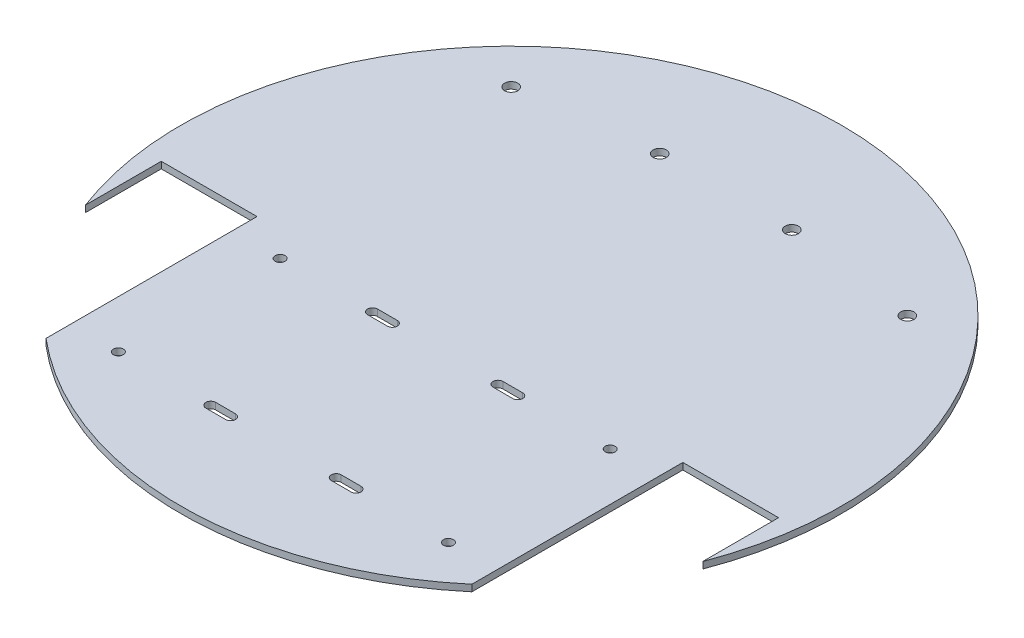
ISO-10303-21;
HEADER;
FILE_DESCRIPTION(('STEP AP214'),'2;1');
FILE_NAME('part.step','',(''),(''),'','','');
FILE_SCHEMA(('AUTOMOTIVE_DESIGN { 1 0 10303 214 1 1 1 1 }'));
ENDSEC;
DATA;
#1=APPLICATION_CONTEXT('core data for automotive mechanical design processes');
#2=APPLICATION_PROTOCOL_DEFINITION('international standard','automotive_design',2000,#1);
#3=PRODUCT_CONTEXT('',#1,'mechanical');
#4=PRODUCT('Part','Part','',(#3));
#5=PRODUCT_RELATED_PRODUCT_CATEGORY('part','',(#4));
#6=PRODUCT_DEFINITION_FORMATION('','',#4);
#7=PRODUCT_DEFINITION_CONTEXT('part definition',#1,'design');
#8=PRODUCT_DEFINITION('design','',#6,#7);
#9=PRODUCT_DEFINITION_SHAPE('','',#8);
#10=(LENGTH_UNIT() NAMED_UNIT(*) SI_UNIT(.MILLI.,.METRE.));
#11=(NAMED_UNIT(*) PLANE_ANGLE_UNIT() SI_UNIT($,.RADIAN.));
#12=(NAMED_UNIT(*) SI_UNIT($,.STERADIAN.) SOLID_ANGLE_UNIT());
#13=UNCERTAINTY_MEASURE_WITH_UNIT(LENGTH_MEASURE(1.E-05),#10,'distance_accuracy_value','');
#14=(GEOMETRIC_REPRESENTATION_CONTEXT(3) GLOBAL_UNCERTAINTY_ASSIGNED_CONTEXT((#13)) GLOBAL_UNIT_ASSIGNED_CONTEXT((#10,
#11,#12)) REPRESENTATION_CONTEXT('',''));
#15=CARTESIAN_POINT('',(0.,0.,0.));
#16=DIRECTION('',(0.,0.,1.));
#17=DIRECTION('',(1.,0.,0.));
#18=AXIS2_PLACEMENT_3D('',#15,#16,#17);
#19=CARTESIAN_POINT('',(93.5,2.,-1.13005537547703E-13));
#20=DIRECTION('',(1.,0.,0.));
#21=DIRECTION('',(0.,0.,-1.));
#22=AXIS2_PLACEMENT_3D('',#19,#20,#21);
#23=PLANE('',#22);
#24=DIRECTION('',(0.,0.,1.));
#25=VECTOR('',#24,1.);
#26=CARTESIAN_POINT('',(93.5,0.,-1.13005537547703E-13));
#27=LINE('',#26,#25);
#28=CARTESIAN_POINT('',(93.5,0.,12.5));
#29=VERTEX_POINT('',#28);
#30=CARTESIAN_POINT('',(93.5,0.,35.4647712526107));
#31=VERTEX_POINT('',#30);
#32=EDGE_CURVE('E304',#29,#31,#27,.T.);
#33=ORIENTED_EDGE('',*,*,#32,.T.);
#34=DIRECTION('',(0.,-1.,0.));
#35=VECTOR('',#34,1.);
#36=CARTESIAN_POINT('',(93.5,2.,35.4647712526107));
#37=LINE('',#36,#35);
#38=CARTESIAN_POINT('',(93.5,2.,35.4647712526107));
#39=VERTEX_POINT('',#38);
#40=EDGE_CURVE('E11',#39,#31,#37,.T.);
#41=ORIENTED_EDGE('',*,*,#40,.F.);
#42=DIRECTION('',(0.,0.,1.));
#43=VECTOR('',#42,1.);
#44=CARTESIAN_POINT('',(93.5,2.,-1.13005537547703E-13));
#45=LINE('',#44,#43);
#46=CARTESIAN_POINT('',(93.5,2.,12.5));
#47=VERTEX_POINT('',#46);
#48=EDGE_CURVE('E436',#47,#39,#45,.T.);
#49=ORIENTED_EDGE('',*,*,#48,.F.);
#50=DIRECTION('',(0.,-1.,0.));
#51=VECTOR('',#50,1.);
#52=CARTESIAN_POINT('',(93.5,2.,12.5));
#53=LINE('',#52,#51);
#54=EDGE_CURVE('E54',#47,#29,#53,.T.);
#55=ORIENTED_EDGE('',*,*,#54,.T.);
#56=EDGE_LOOP('',(#33,#41,#49,#55));
#57=FACE_BOUND('',#56,.T.);
#58=ADVANCED_FACE('F35',(#57),#23,.F.);
#59=CARTESIAN_POINT('',(0.,2.,0.));
#60=DIRECTION('',(0.,-1.,0.));
#61=DIRECTION('',(0.,0.,-1.));
#62=AXIS2_PLACEMENT_3D('',#59,#60,#61);
#63=CYLINDRICAL_SURFACE('',#62,100.);
#64=CARTESIAN_POINT('',(0.,0.,0.));
#65=DIRECTION('',(0.,1.,0.));
#66=DIRECTION('',(0.,0.,1.));
#67=AXIS2_PLACEMENT_3D('',#64,#65,#66);
#68=CIRCLE('',#67,100.);
#69=CARTESIAN_POINT('',(-93.5,0.,35.4647712526107));
#70=VERTEX_POINT('',#69);
#71=EDGE_CURVE('E306',#31,#70,#68,.T.);
#72=ORIENTED_EDGE('',*,*,#71,.T.);
#73=DIRECTION('',(0.,-1.,0.));
#74=VECTOR('',#73,1.);
#75=CARTESIAN_POINT('',(-93.5,2.,35.4647712526107));
#76=LINE('',#75,#74);
#77=CARTESIAN_POINT('',(-93.5,2.,35.4647712526107));
#78=VERTEX_POINT('',#77);
#79=EDGE_CURVE('E45',#78,#70,#76,.T.);
#80=ORIENTED_EDGE('',*,*,#79,.F.);
#81=CARTESIAN_POINT('',(0.,2.,0.));
#82=DIRECTION('',(0.,1.,0.));
#83=DIRECTION('',(0.,0.,1.));
#84=AXIS2_PLACEMENT_3D('',#81,#82,#83);
#85=CIRCLE('',#84,100.);
#86=EDGE_CURVE('E438',#39,#78,#85,.T.);
#87=ORIENTED_EDGE('',*,*,#86,.F.);
#88=ORIENTED_EDGE('',*,*,#40,.T.);
#89=EDGE_LOOP('',(#72,#80,#87,#88));
#90=FACE_BOUND('',#89,.T.);
#91=ADVANCED_FACE('F471',(#90),#63,.T.);
#92=CARTESIAN_POINT('',(-93.5,2.,-1.13005537547703E-13));
#93=DIRECTION('',(1.,0.,0.));
#94=DIRECTION('',(0.,0.,-1.));
#95=AXIS2_PLACEMENT_3D('',#92,#93,#94);
#96=PLANE('',#95);
#97=DIRECTION('',(0.,0.,1.));
#98=VECTOR('',#97,1.);
#99=CARTESIAN_POINT('',(-93.5,0.,-1.13005537547703E-13));
#100=LINE('',#99,#98);
#101=CARTESIAN_POINT('',(-93.5,0.,12.5));
#102=VERTEX_POINT('',#101);
#103=EDGE_CURVE('E309',#102,#70,#100,.T.);
#104=ORIENTED_EDGE('',*,*,#103,.F.);
#105=DIRECTION('',(0.,-1.,0.));
#106=VECTOR('',#105,1.);
#107=CARTESIAN_POINT('',(-93.5,2.,12.5));
#108=LINE('',#107,#106);
#109=CARTESIAN_POINT('',(-93.5,2.,12.5));
#110=VERTEX_POINT('',#109);
#111=EDGE_CURVE('E336',#110,#102,#108,.T.);
#112=ORIENTED_EDGE('',*,*,#111,.F.);
#113=DIRECTION('',(0.,0.,1.));
#114=VECTOR('',#113,1.);
#115=CARTESIAN_POINT('',(-93.5,2.,-1.13005537547703E-13));
#116=LINE('',#115,#114);
#117=EDGE_CURVE('E440',#110,#78,#116,.T.);
#118=ORIENTED_EDGE('',*,*,#117,.T.);
#119=ORIENTED_EDGE('',*,*,#79,.T.);
#120=EDGE_LOOP('',(#104,#112,#118,#119));
#121=FACE_BOUND('',#120,.T.);
#122=ADVANCED_FACE('F476',(#121),#96,.T.);
#123=CARTESIAN_POINT('',(0.,2.,12.5));
#124=DIRECTION('',(0.,0.,-1.));
#125=DIRECTION('',(-1.,0.,0.));
#126=AXIS2_PLACEMENT_3D('',#123,#124,#125);
#127=PLANE('',#126);
#128=DIRECTION('',(1.,0.,0.));
#129=VECTOR('',#128,1.);
#130=CARTESIAN_POINT('',(0.,0.,12.5));
#131=LINE('',#130,#129);
#132=CARTESIAN_POINT('',(-64.5,0.,12.5));
#133=VERTEX_POINT('',#132);
#134=EDGE_CURVE('E312',#102,#133,#131,.T.);
#135=ORIENTED_EDGE('',*,*,#134,.T.);
#136=DIRECTION('',(0.,-1.,0.));
#137=VECTOR('',#136,1.);
#138=CARTESIAN_POINT('',(-64.5,2.,12.5));
#139=LINE('',#138,#137);
#140=CARTESIAN_POINT('',(-64.5,2.,12.5));
#141=VERTEX_POINT('',#140);
#142=EDGE_CURVE('E333',#141,#133,#139,.T.);
#143=ORIENTED_EDGE('',*,*,#142,.F.);
#144=DIRECTION('',(1.,0.,0.));
#145=VECTOR('',#144,1.);
#146=CARTESIAN_POINT('',(0.,2.,12.5));
#147=LINE('',#146,#145);
#148=EDGE_CURVE('E443',#110,#141,#147,.T.);
#149=ORIENTED_EDGE('',*,*,#148,.F.);
#150=ORIENTED_EDGE('',*,*,#111,.T.);
#151=EDGE_LOOP('',(#135,#143,#149,#150));
#152=FACE_BOUND('',#151,.T.);
#153=ADVANCED_FACE('F448',(#152),#127,.F.);
#154=CARTESIAN_POINT('',(-64.5,2.,0.));
#155=DIRECTION('',(1.,0.,0.));
#156=DIRECTION('',(0.,0.,-1.));
#157=AXIS2_PLACEMENT_3D('',#154,#155,#156);
#158=PLANE('',#157);
#159=DIRECTION('',(0.,0.,1.));
#160=VECTOR('',#159,1.);
#161=CARTESIAN_POINT('',(-64.5,0.,0.));
#162=LINE('',#161,#160);
#163=CARTESIAN_POINT('',(-64.5,0.,76.4182569809074));
#164=VERTEX_POINT('',#163);
#165=EDGE_CURVE('E314',#133,#164,#162,.T.);
#166=ORIENTED_EDGE('',*,*,#165,.T.);
#167=DIRECTION('',(0.,-1.,0.));
#168=VECTOR('',#167,1.);
#169=CARTESIAN_POINT('',(-64.5,2.,76.4182569809074));
#170=LINE('',#169,#168);
#171=CARTESIAN_POINT('',(-64.5,2.,76.4182569809074));
#172=VERTEX_POINT('',#171);
#173=EDGE_CURVE('E225',#172,#164,#170,.T.);
#174=ORIENTED_EDGE('',*,*,#173,.F.);
#175=DIRECTION('',(0.,0.,1.));
#176=VECTOR('',#175,1.);
#177=CARTESIAN_POINT('',(-64.5,2.,0.));
#178=LINE('',#177,#176);
#179=EDGE_CURVE('E213',#141,#172,#178,.T.);
#180=ORIENTED_EDGE('',*,*,#179,.F.);
#181=ORIENTED_EDGE('',*,*,#142,.T.);
#182=EDGE_LOOP('',(#166,#174,#180,#181));
#183=FACE_BOUND('',#182,.T.);
#184=ADVANCED_FACE('F452',(#183),#158,.F.);
#185=CARTESIAN_POINT('',(0.,2.,0.));
#186=DIRECTION('',(0.,-1.,0.));
#187=DIRECTION('',(0.,0.,-1.));
#188=AXIS2_PLACEMENT_3D('',#185,#186,#187);
#189=CYLINDRICAL_SURFACE('',#188,100.);
#190=CARTESIAN_POINT('',(0.,0.,0.));
#191=DIRECTION('',(0.,1.,0.));
#192=DIRECTION('',(0.,0.,1.));
#193=AXIS2_PLACEMENT_3D('',#190,#191,#192);
#194=CIRCLE('',#193,100.);
#195=CARTESIAN_POINT('',(64.5,0.,76.4182569809074));
#196=VERTEX_POINT('',#195);
#197=EDGE_CURVE('E222',#164,#196,#194,.T.);
#198=ORIENTED_EDGE('',*,*,#197,.T.);
#199=DIRECTION('',(0.,-1.,0.));
#200=VECTOR('',#199,1.);
#201=CARTESIAN_POINT('',(64.5,2.,76.4182569809074));
#202=LINE('',#201,#200);
#203=CARTESIAN_POINT('',(64.5,2.,76.4182569809074));
#204=VERTEX_POINT('',#203);
#205=EDGE_CURVE('E219',#204,#196,#202,.T.);
#206=ORIENTED_EDGE('',*,*,#205,.F.);
#207=CARTESIAN_POINT('',(0.,2.,0.));
#208=DIRECTION('',(0.,1.,0.));
#209=DIRECTION('',(0.,0.,1.));
#210=AXIS2_PLACEMENT_3D('',#207,#208,#209);
#211=CIRCLE('',#210,100.);
#212=EDGE_CURVE('E204',#172,#204,#211,.T.);
#213=ORIENTED_EDGE('',*,*,#212,.F.);
#214=ORIENTED_EDGE('',*,*,#173,.T.);
#215=EDGE_LOOP('',(#198,#206,#213,#214));
#216=FACE_BOUND('',#215,.T.);
#217=ADVANCED_FACE('F220',(#216),#189,.T.);
#218=CARTESIAN_POINT('',(64.5,2.,0.));
#219=DIRECTION('',(1.,0.,0.));
#220=DIRECTION('',(0.,0.,-1.));
#221=AXIS2_PLACEMENT_3D('',#218,#219,#220);
#222=PLANE('',#221);
#223=DIRECTION('',(0.,0.,1.));
#224=VECTOR('',#223,1.);
#225=CARTESIAN_POINT('',(64.5,0.,0.));
#226=LINE('',#225,#224);
#227=CARTESIAN_POINT('',(64.5,0.,12.5));
#228=VERTEX_POINT('',#227);
#229=EDGE_CURVE('E317',#228,#196,#226,.T.);
#230=ORIENTED_EDGE('',*,*,#229,.F.);
#231=DIRECTION('',(0.,-1.,0.));
#232=VECTOR('',#231,1.);
#233=CARTESIAN_POINT('',(64.5,2.,12.5));
#234=LINE('',#233,#232);
#235=CARTESIAN_POINT('',(64.5,2.,12.5));
#236=VERTEX_POINT('',#235);
#237=EDGE_CURVE('E128',#236,#228,#234,.T.);
#238=ORIENTED_EDGE('',*,*,#237,.F.);
#239=DIRECTION('',(0.,0.,1.));
#240=VECTOR('',#239,1.);
#241=CARTESIAN_POINT('',(64.5,2.,0.));
#242=LINE('',#241,#240);
#243=EDGE_CURVE('E211',#236,#204,#242,.T.);
#244=ORIENTED_EDGE('',*,*,#243,.T.);
#245=ORIENTED_EDGE('',*,*,#205,.T.);
#246=EDGE_LOOP('',(#230,#238,#244,#245));
#247=FACE_BOUND('',#246,.T.);
#248=ADVANCED_FACE('F227',(#247),#222,.T.);
#249=CARTESIAN_POINT('',(0.,2.,18.5));
#250=DIRECTION('',(0.,0.,-1.));
#251=DIRECTION('',(-1.,0.,0.));
#252=AXIS2_PLACEMENT_3D('',#249,#250,#251);
#253=PLANE('',#252);
#254=DIRECTION('',(1.,0.,0.));
#255=VECTOR('',#254,1.);
#256=CARTESIAN_POINT('',(0.,0.,18.5));
#257=LINE('',#256,#255);
#258=CARTESIAN_POINT('',(16.0000000000001,0.,18.5));
#259=VERTEX_POINT('',#258);
#260=CARTESIAN_POINT('',(22.0000000000001,0.,18.5));
#261=VERTEX_POINT('',#260);
#262=EDGE_CURVE('E293',#259,#261,#257,.T.);
#263=ORIENTED_EDGE('',*,*,#262,.T.);
#264=DIRECTION('',(0.,-1.,0.));
#265=VECTOR('',#264,1.);
#266=CARTESIAN_POINT('',(22.0000000000001,2.,18.5));
#267=LINE('',#266,#265);
#268=CARTESIAN_POINT('',(22.0000000000001,2.,18.5));
#269=VERTEX_POINT('',#268);
#270=EDGE_CURVE('E330',#269,#261,#267,.T.);
#271=ORIENTED_EDGE('',*,*,#270,.F.);
#272=DIRECTION('',(1.,0.,0.));
#273=VECTOR('',#272,1.);
#274=CARTESIAN_POINT('',(0.,2.,18.5));
#275=LINE('',#274,#273);
#276=CARTESIAN_POINT('',(16.0000000000001,2.,18.5));
#277=VERTEX_POINT('',#276);
#278=EDGE_CURVE('E426',#277,#269,#275,.T.);
#279=ORIENTED_EDGE('',*,*,#278,.F.);
#280=DIRECTION('',(0.,-1.,0.));
#281=VECTOR('',#280,1.);
#282=CARTESIAN_POINT('',(16.0000000000001,2.,18.5));
#283=LINE('',#282,#281);
#284=EDGE_CURVE('E339',#277,#259,#283,.T.);
#285=ORIENTED_EDGE('',*,*,#284,.T.);
#286=EDGE_LOOP('',(#263,#271,#279,#285));
#287=FACE_BOUND('',#286,.T.);
#288=ADVANCED_FACE('F489',(#287),#253,.F.);
#289=CARTESIAN_POINT('',(22.0000000000001,2.,20.));
#290=DIRECTION('',(0.,-1.,0.));
#291=DIRECTION('',(0.,0.,-1.));
#292=AXIS2_PLACEMENT_3D('',#289,#290,#291);
#293=CYLINDRICAL_SURFACE('',#292,1.49999999999999);
#294=CARTESIAN_POINT('',(22.0000000000001,0.,20.));
#295=DIRECTION('',(0.,1.,0.));
#296=DIRECTION('',(0.,0.,1.));
#297=AXIS2_PLACEMENT_3D('',#294,#295,#296);
#298=CIRCLE('',#297,1.49999999999999);
#299=CARTESIAN_POINT('',(22.0000000000001,0.,21.5));
#300=VERTEX_POINT('',#299);
#301=EDGE_CURVE('E296',#261,#300,#298,.F.);
#302=ORIENTED_EDGE('',*,*,#301,.T.);
#303=DIRECTION('',(0.,-1.,0.));
#304=VECTOR('',#303,1.);
#305=CARTESIAN_POINT('',(22.0000000000001,2.,21.5));
#306=LINE('',#305,#304);
#307=CARTESIAN_POINT('',(22.0000000000001,2.,21.5));
#308=VERTEX_POINT('',#307);
#309=EDGE_CURVE('E345',#308,#300,#306,.T.);
#310=ORIENTED_EDGE('',*,*,#309,.F.);
#311=CARTESIAN_POINT('',(22.0000000000001,2.,20.));
#312=DIRECTION('',(0.,1.,0.));
#313=DIRECTION('',(0.,0.,1.));
#314=AXIS2_PLACEMENT_3D('',#311,#312,#313);
#315=CIRCLE('',#314,1.49999999999999);
#316=EDGE_CURVE('E429',#269,#308,#315,.F.);
#317=ORIENTED_EDGE('',*,*,#316,.F.);
#318=ORIENTED_EDGE('',*,*,#270,.T.);
#319=EDGE_LOOP('',(#302,#310,#317,#318));
#320=FACE_BOUND('',#319,.T.);
#321=ADVANCED_FACE('F485',(#320),#293,.F.);
#322=CARTESIAN_POINT('',(0.,2.,21.5));
#323=DIRECTION('',(0.,0.,-1.));
#324=DIRECTION('',(-1.,0.,0.));
#325=AXIS2_PLACEMENT_3D('',#322,#323,#324);
#326=PLANE('',#325);
#327=DIRECTION('',(1.,0.,0.));
#328=VECTOR('',#327,1.);
#329=CARTESIAN_POINT('',(0.,0.,21.5));
#330=LINE('',#329,#328);
#331=CARTESIAN_POINT('',(16.0000000000001,0.,21.5));
#332=VERTEX_POINT('',#331);
#333=EDGE_CURVE('E299',#332,#300,#330,.T.);
#334=ORIENTED_EDGE('',*,*,#333,.F.);
#335=DIRECTION('',(0.,-1.,0.));
#336=VECTOR('',#335,1.);
#337=CARTESIAN_POINT('',(16.0000000000001,2.,21.5));
#338=LINE('',#337,#336);
#339=CARTESIAN_POINT('',(16.0000000000001,2.,21.5));
#340=VERTEX_POINT('',#339);
#341=EDGE_CURVE('E342',#340,#332,#338,.T.);
#342=ORIENTED_EDGE('',*,*,#341,.F.);
#343=DIRECTION('',(1.,0.,0.));
#344=VECTOR('',#343,1.);
#345=CARTESIAN_POINT('',(0.,2.,21.5));
#346=LINE('',#345,#344);
#347=EDGE_CURVE('E431',#340,#308,#346,.T.);
#348=ORIENTED_EDGE('',*,*,#347,.T.);
#349=ORIENTED_EDGE('',*,*,#309,.T.);
#350=EDGE_LOOP('',(#334,#342,#348,#349));
#351=FACE_BOUND('',#350,.T.);
#352=ADVANCED_FACE('F481',(#351),#326,.T.);
#353=CARTESIAN_POINT('',(0.,2.,70.5));
#354=DIRECTION('',(0.,0.,1.));
#355=DIRECTION('',(1.,0.,0.));
#356=AXIS2_PLACEMENT_3D('',#353,#354,#355);
#357=PLANE('',#356);
#358=DIRECTION('',(-1.,0.,0.));
#359=VECTOR('',#358,1.);
#360=CARTESIAN_POINT('',(0.,0.,70.5));
#361=LINE('',#360,#359);
#362=CARTESIAN_POINT('',(-16.,0.,70.5));
#363=VERTEX_POINT('',#362);
#364=CARTESIAN_POINT('',(-22.,0.,70.5));
#365=VERTEX_POINT('',#364);
#366=EDGE_CURVE('E276',#363,#365,#361,.T.);
#367=ORIENTED_EDGE('',*,*,#366,.T.);
#368=DIRECTION('',(0.,-1.,0.));
#369=VECTOR('',#368,1.);
#370=CARTESIAN_POINT('',(-22.,2.,70.5));
#371=LINE('',#370,#369);
#372=CARTESIAN_POINT('',(-22.,2.,70.5));
#373=VERTEX_POINT('',#372);
#374=EDGE_CURVE('E343',#373,#365,#371,.T.);
#375=ORIENTED_EDGE('',*,*,#374,.F.);
#376=DIRECTION('',(-1.,0.,0.));
#377=VECTOR('',#376,1.);
#378=CARTESIAN_POINT('',(0.,2.,70.5));
#379=LINE('',#378,#377);
#380=CARTESIAN_POINT('',(-16.,2.,70.5));
#381=VERTEX_POINT('',#380);
#382=EDGE_CURVE('E410',#381,#373,#379,.T.);
#383=ORIENTED_EDGE('',*,*,#382,.F.);
#384=DIRECTION('',(0.,-1.,0.));
#385=VECTOR('',#384,1.);
#386=CARTESIAN_POINT('',(-16.,2.,70.5));
#387=LINE('',#386,#385);
#388=EDGE_CURVE('E349',#381,#363,#387,.T.);
#389=ORIENTED_EDGE('',*,*,#388,.T.);
#390=EDGE_LOOP('',(#367,#375,#383,#389));
#391=FACE_BOUND('',#390,.T.);
#392=ADVANCED_FACE('F484',(#391),#357,.F.);
#393=CARTESIAN_POINT('',(-22.,2.,69.));
#394=DIRECTION('',(0.,-1.,0.));
#395=DIRECTION('',(0.,0.,-1.));
#396=AXIS2_PLACEMENT_3D('',#393,#394,#395);
#397=CYLINDRICAL_SURFACE('',#396,1.49999999999999);
#398=CARTESIAN_POINT('',(-22.,0.,69.));
#399=DIRECTION('',(0.,1.,0.));
#400=DIRECTION('',(0.,0.,1.));
#401=AXIS2_PLACEMENT_3D('',#398,#399,#400);
#402=CIRCLE('',#401,1.49999999999999);
#403=CARTESIAN_POINT('',(-22.,0.,67.5));
#404=VERTEX_POINT('',#403);
#405=EDGE_CURVE('E279',#365,#404,#402,.F.);
#406=ORIENTED_EDGE('',*,*,#405,.T.);
#407=DIRECTION('',(0.,-1.,0.));
#408=VECTOR('',#407,1.);
#409=CARTESIAN_POINT('',(-22.,2.,67.5));
#410=LINE('',#409,#408);
#411=CARTESIAN_POINT('',(-22.,2.,67.5));
#412=VERTEX_POINT('',#411);
#413=EDGE_CURVE('E355',#412,#404,#410,.T.);
#414=ORIENTED_EDGE('',*,*,#413,.F.);
#415=CARTESIAN_POINT('',(-22.,2.,69.));
#416=DIRECTION('',(0.,1.,0.));
#417=DIRECTION('',(0.,0.,1.));
#418=AXIS2_PLACEMENT_3D('',#415,#416,#417);
#419=CIRCLE('',#418,1.49999999999999);
#420=EDGE_CURVE('E413',#373,#412,#419,.F.);
#421=ORIENTED_EDGE('',*,*,#420,.F.);
#422=ORIENTED_EDGE('',*,*,#374,.T.);
#423=EDGE_LOOP('',(#406,#414,#421,#422));
#424=FACE_BOUND('',#423,.T.);
#425=ADVANCED_FACE('F510',(#424),#397,.F.);
#426=CARTESIAN_POINT('',(0.,2.,67.5));
#427=DIRECTION('',(0.,0.,1.));
#428=DIRECTION('',(1.,0.,0.));
#429=AXIS2_PLACEMENT_3D('',#426,#427,#428);
#430=PLANE('',#429);
#431=DIRECTION('',(-1.,0.,0.));
#432=VECTOR('',#431,1.);
#433=CARTESIAN_POINT('',(0.,0.,67.5));
#434=LINE('',#433,#432);
#435=CARTESIAN_POINT('',(-16.,0.,67.5));
#436=VERTEX_POINT('',#435);
#437=EDGE_CURVE('E282',#436,#404,#434,.T.);
#438=ORIENTED_EDGE('',*,*,#437,.F.);
#439=DIRECTION('',(0.,-1.,0.));
#440=VECTOR('',#439,1.);
#441=CARTESIAN_POINT('',(-16.,2.,67.5));
#442=LINE('',#441,#440);
#443=CARTESIAN_POINT('',(-16.,2.,67.5));
#444=VERTEX_POINT('',#443);
#445=EDGE_CURVE('E352',#444,#436,#442,.T.);
#446=ORIENTED_EDGE('',*,*,#445,.F.);
#447=DIRECTION('',(-1.,0.,0.));
#448=VECTOR('',#447,1.);
#449=CARTESIAN_POINT('',(0.,2.,67.5));
#450=LINE('',#449,#448);
#451=EDGE_CURVE('E415',#444,#412,#450,.T.);
#452=ORIENTED_EDGE('',*,*,#451,.T.);
#453=ORIENTED_EDGE('',*,*,#413,.T.);
#454=EDGE_LOOP('',(#438,#446,#452,#453));
#455=FACE_BOUND('',#454,.T.);
#456=ADVANCED_FACE('F506',(#455),#430,.T.);
#457=CARTESIAN_POINT('',(-22.,2.,20.));
#458=DIRECTION('',(0.,-1.,0.));
#459=DIRECTION('',(0.,0.,-1.));
#460=AXIS2_PLACEMENT_3D('',#457,#458,#459);
#461=CYLINDRICAL_SURFACE('',#460,1.5);
#462=CARTESIAN_POINT('',(-22.,0.,20.));
#463=DIRECTION('',(0.,1.,0.));
#464=DIRECTION('',(0.,0.,1.));
#465=AXIS2_PLACEMENT_3D('',#462,#463,#464);
#466=CIRCLE('',#465,1.5);
#467=CARTESIAN_POINT('',(-22.,0.,18.5));
#468=VERTEX_POINT('',#467);
#469=CARTESIAN_POINT('',(-22.,0.,21.5));
#470=VERTEX_POINT('',#469);
#471=EDGE_CURVE('E264',#468,#470,#466,.T.);
#472=ORIENTED_EDGE('',*,*,#471,.F.);
#473=DIRECTION('',(0.,-1.,0.));
#474=VECTOR('',#473,1.);
#475=CARTESIAN_POINT('',(-22.,2.,18.5));
#476=LINE('',#475,#474);
#477=CARTESIAN_POINT('',(-22.,2.,18.5));
#478=VERTEX_POINT('',#477);
#479=EDGE_CURVE('E353',#478,#468,#476,.T.);
#480=ORIENTED_EDGE('',*,*,#479,.F.);
#481=CARTESIAN_POINT('',(-22.,2.,20.));
#482=DIRECTION('',(0.,1.,0.));
#483=DIRECTION('',(0.,0.,1.));
#484=AXIS2_PLACEMENT_3D('',#481,#482,#483);
#485=CIRCLE('',#484,1.5);
#486=CARTESIAN_POINT('',(-22.,2.,21.5));
#487=VERTEX_POINT('',#486);
#488=EDGE_CURVE('E392',#478,#487,#485,.T.);
#489=ORIENTED_EDGE('',*,*,#488,.T.);
#490=DIRECTION('',(0.,-1.,0.));
#491=VECTOR('',#490,1.);
#492=CARTESIAN_POINT('',(-22.,2.,21.5));
#493=LINE('',#492,#491);
#494=EDGE_CURVE('E359',#487,#470,#493,.T.);
#495=ORIENTED_EDGE('',*,*,#494,.T.);
#496=EDGE_LOOP('',(#472,#480,#489,#495));
#497=FACE_BOUND('',#496,.T.);
#498=ADVANCED_FACE('F509',(#497),#461,.F.);
#499=CARTESIAN_POINT('',(0.,2.,18.5));
#500=DIRECTION('',(0.,0.,1.));
#501=DIRECTION('',(1.,0.,0.));
#502=AXIS2_PLACEMENT_3D('',#499,#500,#501);
#503=PLANE('',#502);
#504=DIRECTION('',(-1.,0.,0.));
#505=VECTOR('',#504,1.);
#506=CARTESIAN_POINT('',(0.,0.,18.5));
#507=LINE('',#506,#505);
#508=CARTESIAN_POINT('',(-16.,0.,18.5));
#509=VERTEX_POINT('',#508);
#510=EDGE_CURVE('E267',#509,#468,#507,.T.);
#511=ORIENTED_EDGE('',*,*,#510,.F.);
#512=DIRECTION('',(0.,-1.,0.));
#513=VECTOR('',#512,1.);
#514=CARTESIAN_POINT('',(-16.,2.,18.5));
#515=LINE('',#514,#513);
#516=CARTESIAN_POINT('',(-16.,2.,18.5));
#517=VERTEX_POINT('',#516);
#518=EDGE_CURVE('E363',#517,#509,#515,.T.);
#519=ORIENTED_EDGE('',*,*,#518,.F.);
#520=DIRECTION('',(-1.,0.,0.));
#521=VECTOR('',#520,1.);
#522=CARTESIAN_POINT('',(0.,2.,18.5));
#523=LINE('',#522,#521);
#524=EDGE_CURVE('E402',#517,#478,#523,.T.);
#525=ORIENTED_EDGE('',*,*,#524,.T.);
#526=ORIENTED_EDGE('',*,*,#479,.T.);
#527=EDGE_LOOP('',(#511,#519,#525,#526));
#528=FACE_BOUND('',#527,.T.);
#529=ADVANCED_FACE('F524',(#528),#503,.T.);
#530=CARTESIAN_POINT('',(-16.,2.,20.));
#531=DIRECTION('',(0.,-1.,0.));
#532=DIRECTION('',(0.,0.,-1.));
#533=AXIS2_PLACEMENT_3D('',#530,#531,#532);
#534=CYLINDRICAL_SURFACE('',#533,1.5);
#535=CARTESIAN_POINT('',(-16.,0.,20.));
#536=DIRECTION('',(0.,1.,0.));
#537=DIRECTION('',(0.,0.,1.));
#538=AXIS2_PLACEMENT_3D('',#535,#536,#537);
#539=CIRCLE('',#538,1.5);
#540=CARTESIAN_POINT('',(-16.,0.,21.5));
#541=VERTEX_POINT('',#540);
#542=EDGE_CURVE('E270',#541,#509,#539,.T.);
#543=ORIENTED_EDGE('',*,*,#542,.F.);
#544=DIRECTION('',(0.,-1.,0.));
#545=VECTOR('',#544,1.);
#546=CARTESIAN_POINT('',(-16.,2.,21.5));
#547=LINE('',#546,#545);
#548=CARTESIAN_POINT('',(-16.,2.,21.5));
#549=VERTEX_POINT('',#548);
#550=EDGE_CURVE('E361',#549,#541,#547,.T.);
#551=ORIENTED_EDGE('',*,*,#550,.F.);
#552=CARTESIAN_POINT('',(-16.,2.,20.));
#553=DIRECTION('',(0.,1.,0.));
#554=DIRECTION('',(0.,0.,1.));
#555=AXIS2_PLACEMENT_3D('',#552,#553,#554);
#556=CIRCLE('',#555,1.5);
#557=EDGE_CURVE('E405',#549,#517,#556,.T.);
#558=ORIENTED_EDGE('',*,*,#557,.T.);
#559=ORIENTED_EDGE('',*,*,#518,.T.);
#560=EDGE_LOOP('',(#543,#551,#558,#559));
#561=FACE_BOUND('',#560,.T.);
#562=ADVANCED_FACE('F521',(#561),#534,.F.);
#563=CARTESIAN_POINT('',(22.0000000000001,2.,69.));
#564=DIRECTION('',(0.,-1.,0.));
#565=DIRECTION('',(0.,0.,-1.));
#566=AXIS2_PLACEMENT_3D('',#563,#564,#565);
#567=CYLINDRICAL_SURFACE('',#566,1.49999999999999);
#568=CARTESIAN_POINT('',(22.0000000000001,0.,69.));
#569=DIRECTION('',(0.,1.,0.));
#570=DIRECTION('',(0.,0.,1.));
#571=AXIS2_PLACEMENT_3D('',#568,#569,#570);
#572=CIRCLE('',#571,1.49999999999999);
#573=CARTESIAN_POINT('',(22.0000000000001,0.,70.5));
#574=VERTEX_POINT('',#573);
#575=CARTESIAN_POINT('',(22.0000000000001,0.,67.5));
#576=VERTEX_POINT('',#575);
#577=EDGE_CURVE('E252',#574,#576,#572,.T.);
#578=ORIENTED_EDGE('',*,*,#577,.F.);
#579=DIRECTION('',(0.,-1.,0.));
#580=VECTOR('',#579,1.);
#581=CARTESIAN_POINT('',(22.0000000000001,2.,70.5));
#582=LINE('',#581,#580);
#583=CARTESIAN_POINT('',(22.0000000000001,2.,70.5));
#584=VERTEX_POINT('',#583);
#585=EDGE_CURVE('E39',#584,#574,#582,.T.);
#586=ORIENTED_EDGE('',*,*,#585,.F.);
#587=CARTESIAN_POINT('',(22.0000000000001,2.,69.));
#588=DIRECTION('',(0.,1.,0.));
#589=DIRECTION('',(0.,0.,1.));
#590=AXIS2_PLACEMENT_3D('',#587,#588,#589);
#591=CIRCLE('',#590,1.49999999999999);
#592=CARTESIAN_POINT('',(22.0000000000001,2.,67.5));
#593=VERTEX_POINT('',#592);
#594=EDGE_CURVE('E396',#584,#593,#591,.T.);
#595=ORIENTED_EDGE('',*,*,#594,.T.);
#596=DIRECTION('',(0.,-1.,0.));
#597=VECTOR('',#596,1.);
#598=CARTESIAN_POINT('',(22.0000000000001,2.,67.5));
#599=LINE('',#598,#597);
#600=EDGE_CURVE('E239',#593,#576,#599,.T.);
#601=ORIENTED_EDGE('',*,*,#600,.T.);
#602=EDGE_LOOP('',(#578,#586,#595,#601));
#603=FACE_BOUND('',#602,.T.);
#604=ADVANCED_FACE('F378',(#603),#567,.F.);
#605=CARTESIAN_POINT('',(0.,2.,70.5));
#606=DIRECTION('',(0.,0.,-1.));
#607=DIRECTION('',(-1.,0.,0.));
#608=AXIS2_PLACEMENT_3D('',#605,#606,#607);
#609=PLANE('',#608);
#610=DIRECTION('',(1.,0.,0.));
#611=VECTOR('',#610,1.);
#612=CARTESIAN_POINT('',(0.,0.,70.5));
#613=LINE('',#612,#611);
#614=CARTESIAN_POINT('',(16.0000000000001,0.,70.5));
#615=VERTEX_POINT('',#614);
#616=EDGE_CURVE('E255',#615,#574,#613,.T.);
#617=ORIENTED_EDGE('',*,*,#616,.F.);
#618=DIRECTION('',(0.,-1.,0.));
#619=VECTOR('',#618,1.);
#620=CARTESIAN_POINT('',(16.0000000000001,2.,70.5));
#621=LINE('',#620,#619);
#622=CARTESIAN_POINT('',(16.0000000000001,2.,70.5));
#623=VERTEX_POINT('',#622);
#624=EDGE_CURVE('E368',#623,#615,#621,.T.);
#625=ORIENTED_EDGE('',*,*,#624,.F.);
#626=DIRECTION('',(1.,0.,0.));
#627=VECTOR('',#626,1.);
#628=CARTESIAN_POINT('',(0.,2.,70.5));
#629=LINE('',#628,#627);
#630=EDGE_CURVE('E377',#623,#584,#629,.T.);
#631=ORIENTED_EDGE('',*,*,#630,.T.);
#632=ORIENTED_EDGE('',*,*,#585,.T.);
#633=EDGE_LOOP('',(#617,#625,#631,#632));
#634=FACE_BOUND('',#633,.T.);
#635=ADVANCED_FACE('F375',(#634),#609,.T.);
#636=CARTESIAN_POINT('',(16.,2.,69.));
#637=DIRECTION('',(0.,-1.,0.));
#638=DIRECTION('',(0.,0.,-1.));
#639=AXIS2_PLACEMENT_3D('',#636,#637,#638);
#640=CYLINDRICAL_SURFACE('',#639,1.49999999999999);
#641=CARTESIAN_POINT('',(16.,0.,69.));
#642=DIRECTION('',(0.,1.,0.));
#643=DIRECTION('',(0.,0.,1.));
#644=AXIS2_PLACEMENT_3D('',#641,#642,#643);
#645=CIRCLE('',#644,1.49999999999999);
#646=CARTESIAN_POINT('',(16.0000000000001,0.,67.5));
#647=VERTEX_POINT('',#646);
#648=EDGE_CURVE('E258',#647,#615,#645,.T.);
#649=ORIENTED_EDGE('',*,*,#648,.F.);
#650=DIRECTION('',(0.,-1.,0.));
#651=VECTOR('',#650,1.);
#652=CARTESIAN_POINT('',(16.0000000000001,2.,67.5));
#653=LINE('',#652,#651);
#654=CARTESIAN_POINT('',(16.0000000000001,2.,67.5));
#655=VERTEX_POINT('',#654);
#656=EDGE_CURVE('E367',#655,#647,#653,.T.);
#657=ORIENTED_EDGE('',*,*,#656,.F.);
#658=CARTESIAN_POINT('',(16.,2.,69.));
#659=DIRECTION('',(0.,1.,0.));
#660=DIRECTION('',(0.,0.,1.));
#661=AXIS2_PLACEMENT_3D('',#658,#659,#660);
#662=CIRCLE('',#661,1.49999999999999);
#663=EDGE_CURVE('E387',#655,#623,#662,.T.);
#664=ORIENTED_EDGE('',*,*,#663,.T.);
#665=ORIENTED_EDGE('',*,*,#624,.T.);
#666=EDGE_LOOP('',(#649,#657,#664,#665));
#667=FACE_BOUND('',#666,.T.);
#668=ADVANCED_FACE('F384',(#667),#640,.F.);
#669=CARTESIAN_POINT('',(-60.,2.,-60.));
#670=DIRECTION('',(0.,-1.,0.));
#671=DIRECTION('',(0.,0.,-1.));
#672=AXIS2_PLACEMENT_3D('',#669,#670,#671);
#673=CYLINDRICAL_SURFACE('',#672,2.);
#674=CARTESIAN_POINT('',(-60.,2.,-60.));
#675=DIRECTION('',(0.,1.,0.));
#676=DIRECTION('',(0.,0.,1.));
#677=AXIS2_PLACEMENT_3D('',#674,#675,#676);
#678=CIRCLE('',#677,2.);
#679=CARTESIAN_POINT('',(-60.,2.,-58.));
#680=VERTEX_POINT('',#679);
#681=EDGE_CURVE('E230',#680,#680,#678,.T.);
#682=ORIENTED_EDGE('',*,*,#681,.T.);
#683=EDGE_LOOP('',(#682));
#684=FACE_BOUND('',#683,.T.);
#685=CARTESIAN_POINT('',(-60.,0.,-60.));
#686=DIRECTION('',(0.,1.,0.));
#687=DIRECTION('',(0.,0.,1.));
#688=AXIS2_PLACEMENT_3D('',#685,#686,#687);
#689=CIRCLE('',#688,2.);
#690=CARTESIAN_POINT('',(-60.,0.,-58.));
#691=VERTEX_POINT('',#690);
#692=EDGE_CURVE('E322',#691,#691,#689,.T.);
#693=ORIENTED_EDGE('',*,*,#692,.F.);
#694=EDGE_LOOP('',(#693));
#695=FACE_BOUND('',#694,.T.);
#696=ADVANCED_FACE('F458',(#684,#695),#673,.F.);
#697=CARTESIAN_POINT('',(0.,2.,12.5000000000001));
#698=DIRECTION('',(0.,0.,1.));
#699=DIRECTION('',(1.,0.,0.));
#700=AXIS2_PLACEMENT_3D('',#697,#698,#699);
#701=PLANE('',#700);
#702=DIRECTION('',(-1.,0.,0.));
#703=VECTOR('',#702,1.);
#704=CARTESIAN_POINT('',(0.,0.,12.5000000000001));
#705=LINE('',#704,#703);
#706=EDGE_CURVE('E319',#29,#228,#705,.T.);
#707=ORIENTED_EDGE('',*,*,#706,.F.);
#708=ORIENTED_EDGE('',*,*,#54,.F.);
#709=DIRECTION('',(-1.,0.,0.));
#710=VECTOR('',#709,1.);
#711=CARTESIAN_POINT('',(0.,2.,12.5000000000001));
#712=LINE('',#711,#710);
#713=EDGE_CURVE('E228',#47,#236,#712,.T.);
#714=ORIENTED_EDGE('',*,*,#713,.T.);
#715=ORIENTED_EDGE('',*,*,#237,.T.);
#716=EDGE_LOOP('',(#707,#708,#714,#715));
#717=FACE_BOUND('',#716,.T.);
#718=ADVANCED_FACE('F455',(#717),#701,.T.);
#719=CARTESIAN_POINT('',(16.,2.,20.));
#720=DIRECTION('',(0.,-1.,0.));
#721=DIRECTION('',(0.,0.,-1.));
#722=AXIS2_PLACEMENT_3D('',#719,#720,#721);
#723=CYLINDRICAL_SURFACE('',#722,1.49999999999999);
#724=CARTESIAN_POINT('',(16.,0.,20.));
#725=DIRECTION('',(0.,1.,0.));
#726=DIRECTION('',(0.,0.,1.));
#727=AXIS2_PLACEMENT_3D('',#724,#725,#726);
#728=CIRCLE('',#727,1.49999999999999);
#729=EDGE_CURVE('E302',#332,#259,#728,.F.);
#730=ORIENTED_EDGE('',*,*,#729,.T.);
#731=ORIENTED_EDGE('',*,*,#284,.F.);
#732=CARTESIAN_POINT('',(16.,2.,20.));
#733=DIRECTION('',(0.,1.,0.));
#734=DIRECTION('',(0.,0.,1.));
#735=AXIS2_PLACEMENT_3D('',#732,#733,#734);
#736=CIRCLE('',#735,1.49999999999999);
#737=EDGE_CURVE('E434',#340,#277,#736,.F.);
#738=ORIENTED_EDGE('',*,*,#737,.F.);
#739=ORIENTED_EDGE('',*,*,#341,.T.);
#740=EDGE_LOOP('',(#730,#731,#738,#739));
#741=FACE_BOUND('',#740,.T.);
#742=ADVANCED_FACE('F457',(#741),#723,.F.);
#743=CARTESIAN_POINT('',(-50.,2.,69.));
#744=DIRECTION('',(0.,-1.,0.));
#745=DIRECTION('',(0.,0.,-1.));
#746=AXIS2_PLACEMENT_3D('',#743,#744,#745);
#747=CYLINDRICAL_SURFACE('',#746,1.5);
#748=CARTESIAN_POINT('',(-50.,2.,69.));
#749=DIRECTION('',(0.,1.,0.));
#750=DIRECTION('',(0.,0.,1.));
#751=AXIS2_PLACEMENT_3D('',#748,#749,#750);
#752=CIRCLE('',#751,1.5);
#753=CARTESIAN_POINT('',(-50.,2.,70.5));
#754=VERTEX_POINT('',#753);
#755=EDGE_CURVE('E423',#754,#754,#752,.F.);
#756=ORIENTED_EDGE('',*,*,#755,.F.);
#757=EDGE_LOOP('',(#756));
#758=FACE_BOUND('',#757,.T.);
#759=CARTESIAN_POINT('',(-50.,0.,69.));
#760=DIRECTION('',(0.,1.,0.));
#761=DIRECTION('',(0.,0.,1.));
#762=AXIS2_PLACEMENT_3D('',#759,#760,#761);
#763=CIRCLE('',#762,1.5);
#764=CARTESIAN_POINT('',(-50.,0.,70.5));
#765=VERTEX_POINT('',#764);
#766=EDGE_CURVE('E290',#765,#765,#763,.F.);
#767=ORIENTED_EDGE('',*,*,#766,.T.);
#768=EDGE_LOOP('',(#767));
#769=FACE_BOUND('',#768,.T.);
#770=ADVANCED_FACE('F464',(#758,#769),#747,.F.);
#771=CARTESIAN_POINT('',(-50.,2.,20.));
#772=DIRECTION('',(0.,-1.,0.));
#773=DIRECTION('',(0.,0.,-1.));
#774=AXIS2_PLACEMENT_3D('',#771,#772,#773);
#775=CYLINDRICAL_SURFACE('',#774,1.5);
#776=CARTESIAN_POINT('',(-50.,2.,20.));
#777=DIRECTION('',(0.,1.,0.));
#778=DIRECTION('',(0.,0.,1.));
#779=AXIS2_PLACEMENT_3D('',#776,#777,#778);
#780=CIRCLE('',#779,1.5);
#781=CARTESIAN_POINT('',(-50.,2.,21.5));
#782=VERTEX_POINT('',#781);
#783=EDGE_CURVE('E420',#782,#782,#780,.T.);
#784=ORIENTED_EDGE('',*,*,#783,.T.);
#785=EDGE_LOOP('',(#784));
#786=FACE_BOUND('',#785,.T.);
#787=CARTESIAN_POINT('',(-50.,0.,20.));
#788=DIRECTION('',(0.,1.,0.));
#789=DIRECTION('',(0.,0.,1.));
#790=AXIS2_PLACEMENT_3D('',#787,#788,#789);
#791=CIRCLE('',#790,1.5);
#792=CARTESIAN_POINT('',(-50.,0.,21.5));
#793=VERTEX_POINT('',#792);
#794=EDGE_CURVE('E287',#793,#793,#791,.T.);
#795=ORIENTED_EDGE('',*,*,#794,.F.);
#796=EDGE_LOOP('',(#795));
#797=FACE_BOUND('',#796,.T.);
#798=ADVANCED_FACE('F496',(#786,#797),#775,.F.);
#799=CARTESIAN_POINT('',(-16.,2.,69.));
#800=DIRECTION('',(0.,-1.,0.));
#801=DIRECTION('',(0.,0.,-1.));
#802=AXIS2_PLACEMENT_3D('',#799,#800,#801);
#803=CYLINDRICAL_SURFACE('',#802,1.49999999999999);
#804=CARTESIAN_POINT('',(-16.,0.,69.));
#805=DIRECTION('',(0.,1.,0.));
#806=DIRECTION('',(0.,0.,1.));
#807=AXIS2_PLACEMENT_3D('',#804,#805,#806);
#808=CIRCLE('',#807,1.49999999999999);
#809=EDGE_CURVE('E285',#436,#363,#808,.F.);
#810=ORIENTED_EDGE('',*,*,#809,.T.);
#811=ORIENTED_EDGE('',*,*,#388,.F.);
#812=CARTESIAN_POINT('',(-16.,2.,69.));
#813=DIRECTION('',(0.,1.,0.));
#814=DIRECTION('',(0.,0.,1.));
#815=AXIS2_PLACEMENT_3D('',#812,#813,#814);
#816=CIRCLE('',#815,1.49999999999999);
#817=EDGE_CURVE('E418',#444,#381,#816,.F.);
#818=ORIENTED_EDGE('',*,*,#817,.F.);
#819=ORIENTED_EDGE('',*,*,#445,.T.);
#820=EDGE_LOOP('',(#810,#811,#818,#819));
#821=FACE_BOUND('',#820,.T.);
#822=ADVANCED_FACE('F500',(#821),#803,.F.);
#823=CARTESIAN_POINT('',(0.,2.,21.5));
#824=DIRECTION('',(0.,0.,1.));
#825=DIRECTION('',(1.,0.,0.));
#826=AXIS2_PLACEMENT_3D('',#823,#824,#825);
#827=PLANE('',#826);
#828=DIRECTION('',(-1.,0.,0.));
#829=VECTOR('',#828,1.);
#830=CARTESIAN_POINT('',(0.,0.,21.5));
#831=LINE('',#830,#829);
#832=EDGE_CURVE('E273',#541,#470,#831,.T.);
#833=ORIENTED_EDGE('',*,*,#832,.T.);
#834=ORIENTED_EDGE('',*,*,#494,.F.);
#835=DIRECTION('',(-1.,0.,0.));
#836=VECTOR('',#835,1.);
#837=CARTESIAN_POINT('',(0.,2.,21.5));
#838=LINE('',#837,#836);
#839=EDGE_CURVE('E408',#549,#487,#838,.T.);
#840=ORIENTED_EDGE('',*,*,#839,.F.);
#841=ORIENTED_EDGE('',*,*,#550,.T.);
#842=EDGE_LOOP('',(#833,#834,#840,#841));
#843=FACE_BOUND('',#842,.T.);
#844=ADVANCED_FACE('F504',(#843),#827,.F.);
#845=CARTESIAN_POINT('',(0.,2.,67.5));
#846=DIRECTION('',(0.,0.,-1.));
#847=DIRECTION('',(-1.,0.,0.));
#848=AXIS2_PLACEMENT_3D('',#845,#846,#847);
#849=PLANE('',#848);
#850=DIRECTION('',(1.,0.,0.));
#851=VECTOR('',#850,1.);
#852=CARTESIAN_POINT('',(0.,0.,67.5));
#853=LINE('',#852,#851);
#854=EDGE_CURVE('E261',#647,#576,#853,.T.);
#855=ORIENTED_EDGE('',*,*,#854,.T.);
#856=ORIENTED_EDGE('',*,*,#600,.F.);
#857=DIRECTION('',(1.,0.,0.));
#858=VECTOR('',#857,1.);
#859=CARTESIAN_POINT('',(0.,2.,67.5));
#860=LINE('',#859,#858);
#861=EDGE_CURVE('E389',#655,#593,#860,.T.);
#862=ORIENTED_EDGE('',*,*,#861,.F.);
#863=ORIENTED_EDGE('',*,*,#656,.T.);
#864=EDGE_LOOP('',(#855,#856,#862,#863));
#865=FACE_BOUND('',#864,.T.);
#866=ADVANCED_FACE('F390',(#865),#849,.F.);
#867=CARTESIAN_POINT('',(50.,2.,69.));
#868=DIRECTION('',(0.,-1.,0.));
#869=DIRECTION('',(0.,0.,-1.));
#870=AXIS2_PLACEMENT_3D('',#867,#868,#869);
#871=CYLINDRICAL_SURFACE('',#870,1.5);
#872=CARTESIAN_POINT('',(50.,2.,69.));
#873=DIRECTION('',(0.,1.,0.));
#874=DIRECTION('',(0.,0.,1.));
#875=AXIS2_PLACEMENT_3D('',#872,#873,#874);
#876=CIRCLE('',#875,1.5);
#877=CARTESIAN_POINT('',(50.,2.,70.5));
#878=VERTEX_POINT('',#877);
#879=EDGE_CURVE('E803',#878,#878,#876,.T.);
#880=ORIENTED_EDGE('',*,*,#879,.T.);
#881=EDGE_LOOP('',(#880));
#882=FACE_BOUND('',#881,.T.);
#883=CARTESIAN_POINT('',(50.,0.,69.));
#884=DIRECTION('',(0.,1.,0.));
#885=DIRECTION('',(0.,0.,1.));
#886=AXIS2_PLACEMENT_3D('',#883,#884,#885);
#887=CIRCLE('',#886,1.5);
#888=CARTESIAN_POINT('',(50.,0.,70.5));
#889=VERTEX_POINT('',#888);
#890=EDGE_CURVE('E249',#889,#889,#887,.T.);
#891=ORIENTED_EDGE('',*,*,#890,.F.);
#892=EDGE_LOOP('',(#891));
#893=FACE_BOUND('',#892,.T.);
#894=ADVANCED_FACE('F534',(#882,#893),#871,.F.);
#895=CARTESIAN_POINT('',(50.,2.,20.));
#896=DIRECTION('',(0.,-1.,0.));
#897=DIRECTION('',(0.,0.,-1.));
#898=AXIS2_PLACEMENT_3D('',#895,#896,#897);
#899=CYLINDRICAL_SURFACE('',#898,1.5);
#900=CARTESIAN_POINT('',(50.,2.,20.));
#901=DIRECTION('',(0.,1.,0.));
#902=DIRECTION('',(0.,0.,1.));
#903=AXIS2_PLACEMENT_3D('',#900,#901,#902);
#904=CIRCLE('',#903,1.5);
#905=CARTESIAN_POINT('',(50.,2.,21.5));
#906=VERTEX_POINT('',#905);
#907=EDGE_CURVE('E800',#906,#906,#904,.F.);
#908=ORIENTED_EDGE('',*,*,#907,.F.);
#909=EDGE_LOOP('',(#908));
#910=FACE_BOUND('',#909,.T.);
#911=CARTESIAN_POINT('',(50.,0.,20.));
#912=DIRECTION('',(0.,1.,0.));
#913=DIRECTION('',(0.,0.,1.));
#914=AXIS2_PLACEMENT_3D('',#911,#912,#913);
#915=CIRCLE('',#914,1.5);
#916=CARTESIAN_POINT('',(50.,0.,21.5));
#917=VERTEX_POINT('',#916);
#918=EDGE_CURVE('E246',#917,#917,#915,.F.);
#919=ORIENTED_EDGE('',*,*,#918,.T.);
#920=EDGE_LOOP('',(#919));
#921=FACE_BOUND('',#920,.T.);
#922=ADVANCED_FACE('F543',(#910,#921),#899,.F.);
#923=CARTESIAN_POINT('',(-20.,2.,-65.));
#924=DIRECTION('',(0.,-1.,0.));
#925=DIRECTION('',(0.,0.,-1.));
#926=AXIS2_PLACEMENT_3D('',#923,#924,#925);
#927=CYLINDRICAL_SURFACE('',#926,2.00000000000001);
#928=CARTESIAN_POINT('',(-20.,2.,-65.));
#929=DIRECTION('',(0.,1.,0.));
#930=DIRECTION('',(0.,0.,1.));
#931=AXIS2_PLACEMENT_3D('',#928,#929,#930);
#932=CIRCLE('',#931,2.00000000000001);
#933=CARTESIAN_POINT('',(-20.,2.,-63.));
#934=VERTEX_POINT('',#933);
#935=EDGE_CURVE('E558',#934,#934,#932,.T.);
#936=ORIENTED_EDGE('',*,*,#935,.T.);
#937=EDGE_LOOP('',(#936));
#938=FACE_BOUND('',#937,.T.);
#939=CARTESIAN_POINT('',(-20.,0.,-65.));
#940=DIRECTION('',(0.,1.,0.));
#941=DIRECTION('',(0.,0.,1.));
#942=AXIS2_PLACEMENT_3D('',#939,#940,#941);
#943=CIRCLE('',#942,2.00000000000001);
#944=CARTESIAN_POINT('',(-20.,0.,-63.));
#945=VERTEX_POINT('',#944);
#946=EDGE_CURVE('E243',#945,#945,#943,.T.);
#947=ORIENTED_EDGE('',*,*,#946,.F.);
#948=EDGE_LOOP('',(#947));
#949=FACE_BOUND('',#948,.T.);
#950=ADVANCED_FACE('F546',(#938,#949),#927,.F.);
#951=CARTESIAN_POINT('',(20.,2.,-65.));
#952=DIRECTION('',(0.,-1.,0.));
#953=DIRECTION('',(0.,0.,-1.));
#954=AXIS2_PLACEMENT_3D('',#951,#952,#953);
#955=CYLINDRICAL_SURFACE('',#954,2.00000000000001);
#956=CARTESIAN_POINT('',(20.,2.,-65.));
#957=DIRECTION('',(0.,1.,0.));
#958=DIRECTION('',(0.,0.,1.));
#959=AXIS2_PLACEMENT_3D('',#956,#957,#958);
#960=CIRCLE('',#959,2.00000000000001);
#961=CARTESIAN_POINT('',(20.,2.,-63.));
#962=VERTEX_POINT('',#961);
#963=EDGE_CURVE('E328',#962,#962,#960,.F.);
#964=ORIENTED_EDGE('',*,*,#963,.F.);
#965=EDGE_LOOP('',(#964));
#966=FACE_BOUND('',#965,.T.);
#967=CARTESIAN_POINT('',(20.,0.,-65.));
#968=DIRECTION('',(0.,1.,0.));
#969=DIRECTION('',(0.,0.,1.));
#970=AXIS2_PLACEMENT_3D('',#967,#968,#969);
#971=CIRCLE('',#970,2.00000000000001);
#972=CARTESIAN_POINT('',(20.,0.,-63.));
#973=VERTEX_POINT('',#972);
#974=EDGE_CURVE('E240',#973,#973,#971,.F.);
#975=ORIENTED_EDGE('',*,*,#974,.T.);
#976=EDGE_LOOP('',(#975));
#977=FACE_BOUND('',#976,.T.);
#978=ADVANCED_FACE('F37',(#966,#977),#955,.F.);
#979=CARTESIAN_POINT('',(60.,2.,-60.));
#980=DIRECTION('',(0.,-1.,0.));
#981=DIRECTION('',(0.,0.,-1.));
#982=AXIS2_PLACEMENT_3D('',#979,#980,#981);
#983=CYLINDRICAL_SURFACE('',#982,2.);
#984=CARTESIAN_POINT('',(60.,2.,-60.));
#985=DIRECTION('',(0.,1.,0.));
#986=DIRECTION('',(0.,0.,1.));
#987=AXIS2_PLACEMENT_3D('',#984,#985,#986);
#988=CIRCLE('',#987,2.);
#989=CARTESIAN_POINT('',(60.,2.,-58.));
#990=VERTEX_POINT('',#989);
#991=EDGE_CURVE('E236',#990,#990,#988,.F.);
#992=ORIENTED_EDGE('',*,*,#991,.F.);
#993=EDGE_LOOP('',(#992));
#994=FACE_BOUND('',#993,.T.);
#995=CARTESIAN_POINT('',(60.,0.,-60.));
#996=DIRECTION('',(0.,1.,0.));
#997=DIRECTION('',(0.,0.,1.));
#998=AXIS2_PLACEMENT_3D('',#995,#996,#997);
#999=CIRCLE('',#998,2.);
#1000=CARTESIAN_POINT('',(60.,0.,-58.));
#1001=VERTEX_POINT('',#1000);
#1002=EDGE_CURVE('E325',#1001,#1001,#999,.F.);
#1003=ORIENTED_EDGE('',*,*,#1002,.T.);
#1004=EDGE_LOOP('',(#1003));
#1005=FACE_BOUND('',#1004,.T.);
#1006=ADVANCED_FACE('F553',(#994,#1005),#983,.F.);
#1007=CARTESIAN_POINT('',(0.,2.,0.));
#1008=DIRECTION('',(0.,1.,0.));
#1009=DIRECTION('',(0.,0.,1.));
#1010=AXIS2_PLACEMENT_3D('',#1007,#1008,#1009);
#1011=PLANE('',#1010);
#1012=ORIENTED_EDGE('',*,*,#963,.T.);
#1013=EDGE_LOOP('',(#1012));
#1014=FACE_BOUND('',#1013,.T.);
#1015=ORIENTED_EDGE('',*,*,#935,.F.);
#1016=EDGE_LOOP('',(#1015));
#1017=FACE_BOUND('',#1016,.T.);
#1018=ORIENTED_EDGE('',*,*,#907,.T.);
#1019=EDGE_LOOP('',(#1018));
#1020=FACE_BOUND('',#1019,.T.);
#1021=ORIENTED_EDGE('',*,*,#879,.F.);
#1022=EDGE_LOOP('',(#1021));
#1023=FACE_BOUND('',#1022,.T.);
#1024=ORIENTED_EDGE('',*,*,#594,.F.);
#1025=ORIENTED_EDGE('',*,*,#630,.F.);
#1026=ORIENTED_EDGE('',*,*,#663,.F.);
#1027=ORIENTED_EDGE('',*,*,#861,.T.);
#1028=EDGE_LOOP('',(#1024,#1025,#1026,#1027));
#1029=FACE_BOUND('',#1028,.T.);
#1030=ORIENTED_EDGE('',*,*,#488,.F.);
#1031=ORIENTED_EDGE('',*,*,#524,.F.);
#1032=ORIENTED_EDGE('',*,*,#557,.F.);
#1033=ORIENTED_EDGE('',*,*,#839,.T.);
#1034=EDGE_LOOP('',(#1030,#1031,#1032,#1033));
#1035=FACE_BOUND('',#1034,.T.);
#1036=ORIENTED_EDGE('',*,*,#382,.T.);
#1037=ORIENTED_EDGE('',*,*,#420,.T.);
#1038=ORIENTED_EDGE('',*,*,#451,.F.);
#1039=ORIENTED_EDGE('',*,*,#817,.T.);
#1040=EDGE_LOOP('',(#1036,#1037,#1038,#1039));
#1041=FACE_BOUND('',#1040,.T.);
#1042=ORIENTED_EDGE('',*,*,#783,.F.);
#1043=EDGE_LOOP('',(#1042));
#1044=FACE_BOUND('',#1043,.T.);
#1045=ORIENTED_EDGE('',*,*,#755,.T.);
#1046=EDGE_LOOP('',(#1045));
#1047=FACE_BOUND('',#1046,.T.);
#1048=ORIENTED_EDGE('',*,*,#278,.T.);
#1049=ORIENTED_EDGE('',*,*,#316,.T.);
#1050=ORIENTED_EDGE('',*,*,#347,.F.);
#1051=ORIENTED_EDGE('',*,*,#737,.T.);
#1052=EDGE_LOOP('',(#1048,#1049,#1050,#1051));
#1053=FACE_BOUND('',#1052,.T.);
#1054=ORIENTED_EDGE('',*,*,#48,.T.);
#1055=ORIENTED_EDGE('',*,*,#86,.T.);
#1056=ORIENTED_EDGE('',*,*,#117,.F.);
#1057=ORIENTED_EDGE('',*,*,#148,.T.);
#1058=ORIENTED_EDGE('',*,*,#179,.T.);
#1059=ORIENTED_EDGE('',*,*,#212,.T.);
#1060=ORIENTED_EDGE('',*,*,#243,.F.);
#1061=ORIENTED_EDGE('',*,*,#713,.F.);
#1062=EDGE_LOOP('',(#1054,#1055,#1056,#1057,#1058,#1059,#1060,#1061));
#1063=FACE_BOUND('',#1062,.T.);
#1064=ORIENTED_EDGE('',*,*,#681,.F.);
#1065=EDGE_LOOP('',(#1064));
#1066=FACE_BOUND('',#1065,.T.);
#1067=ORIENTED_EDGE('',*,*,#991,.T.);
#1068=EDGE_LOOP('',(#1067));
#1069=FACE_BOUND('',#1068,.T.);
#1070=ADVANCED_FACE('F207',(#1014,#1017,#1020,#1023,#1029,#1035,#1041,#1044,#1047,#1053,#1063,
#1066,#1069),#1011,.T.);
#1071=CARTESIAN_POINT('',(0.,0.,0.));
#1072=DIRECTION('',(0.,1.,0.));
#1073=DIRECTION('',(0.,0.,1.));
#1074=AXIS2_PLACEMENT_3D('',#1071,#1072,#1073);
#1075=PLANE('',#1074);
#1076=ORIENTED_EDGE('',*,*,#974,.F.);
#1077=EDGE_LOOP('',(#1076));
#1078=FACE_BOUND('',#1077,.T.);
#1079=ORIENTED_EDGE('',*,*,#946,.T.);
#1080=EDGE_LOOP('',(#1079));
#1081=FACE_BOUND('',#1080,.T.);
#1082=ORIENTED_EDGE('',*,*,#918,.F.);
#1083=EDGE_LOOP('',(#1082));
#1084=FACE_BOUND('',#1083,.T.);
#1085=ORIENTED_EDGE('',*,*,#890,.T.);
#1086=EDGE_LOOP('',(#1085));
#1087=FACE_BOUND('',#1086,.T.);
#1088=ORIENTED_EDGE('',*,*,#577,.T.);
#1089=ORIENTED_EDGE('',*,*,#854,.F.);
#1090=ORIENTED_EDGE('',*,*,#648,.T.);
#1091=ORIENTED_EDGE('',*,*,#616,.T.);
#1092=EDGE_LOOP('',(#1088,#1089,#1090,#1091));
#1093=FACE_BOUND('',#1092,.T.);
#1094=ORIENTED_EDGE('',*,*,#471,.T.);
#1095=ORIENTED_EDGE('',*,*,#832,.F.);
#1096=ORIENTED_EDGE('',*,*,#542,.T.);
#1097=ORIENTED_EDGE('',*,*,#510,.T.);
#1098=EDGE_LOOP('',(#1094,#1095,#1096,#1097));
#1099=FACE_BOUND('',#1098,.T.);
#1100=ORIENTED_EDGE('',*,*,#366,.F.);
#1101=ORIENTED_EDGE('',*,*,#809,.F.);
#1102=ORIENTED_EDGE('',*,*,#437,.T.);
#1103=ORIENTED_EDGE('',*,*,#405,.F.);
#1104=EDGE_LOOP('',(#1100,#1101,#1102,#1103));
#1105=FACE_BOUND('',#1104,.T.);
#1106=ORIENTED_EDGE('',*,*,#794,.T.);
#1107=EDGE_LOOP('',(#1106));
#1108=FACE_BOUND('',#1107,.T.);
#1109=ORIENTED_EDGE('',*,*,#766,.F.);
#1110=EDGE_LOOP('',(#1109));
#1111=FACE_BOUND('',#1110,.T.);
#1112=ORIENTED_EDGE('',*,*,#262,.F.);
#1113=ORIENTED_EDGE('',*,*,#729,.F.);
#1114=ORIENTED_EDGE('',*,*,#333,.T.);
#1115=ORIENTED_EDGE('',*,*,#301,.F.);
#1116=EDGE_LOOP('',(#1112,#1113,#1114,#1115));
#1117=FACE_BOUND('',#1116,.T.);
#1118=ORIENTED_EDGE('',*,*,#32,.F.);
#1119=ORIENTED_EDGE('',*,*,#706,.T.);
#1120=ORIENTED_EDGE('',*,*,#229,.T.);
#1121=ORIENTED_EDGE('',*,*,#197,.F.);
#1122=ORIENTED_EDGE('',*,*,#165,.F.);
#1123=ORIENTED_EDGE('',*,*,#134,.F.);
#1124=ORIENTED_EDGE('',*,*,#103,.T.);
#1125=ORIENTED_EDGE('',*,*,#71,.F.);
#1126=EDGE_LOOP('',(#1118,#1119,#1120,#1121,#1122,#1123,#1124,#1125));
#1127=FACE_BOUND('',#1126,.T.);
#1128=ORIENTED_EDGE('',*,*,#692,.T.);
#1129=EDGE_LOOP('',(#1128));
#1130=FACE_BOUND('',#1129,.T.);
#1131=ORIENTED_EDGE('',*,*,#1002,.F.);
#1132=EDGE_LOOP('',(#1131));
#1133=FACE_BOUND('',#1132,.T.);
#1134=ADVANCED_FACE('F382',(#1078,#1081,#1084,#1087,#1093,#1099,#1105,#1108,#1111,#1117,#1127,
#1130,#1133),#1075,.F.);
#1135=CLOSED_SHELL('',(#58,#91,#122,#153,#184,#217,#248,#288,#321,#352,#392,#425,#456,#498,#529,
#562,#604,#635,#668,#696,#718,#742,#770,#798,#822,#844,#866,#894,#922,#950,#978,#1006,#1070,#1134));
#1136=MANIFOLD_SOLID_BREP('B2',#1135);
#1137=ADVANCED_BREP_SHAPE_REPRESENTATION('',(#18,#1136),#14);
#1138=SHAPE_DEFINITION_REPRESENTATION(#9,#1137);
ENDSEC;
END-ISO-10303-21;
